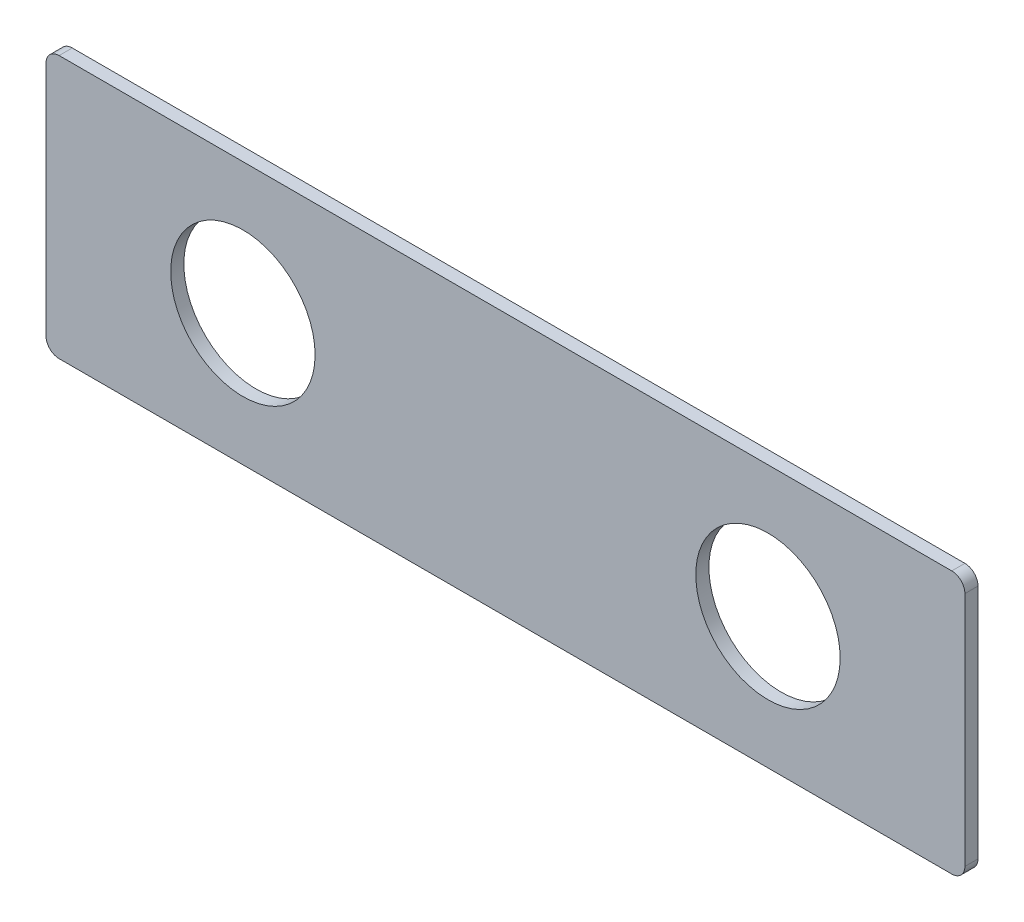
ISO-10303-21;
HEADER;
FILE_DESCRIPTION(('STEP AP214'),'2;1');
FILE_NAME('part.step','',(''),(''),'','','');
FILE_SCHEMA(('AUTOMOTIVE_DESIGN { 1 0 10303 214 1 1 1 1 }'));
ENDSEC;
DATA;
#1=APPLICATION_CONTEXT('core data for automotive mechanical design processes');
#2=APPLICATION_PROTOCOL_DEFINITION('international standard','automotive_design',2000,#1);
#3=PRODUCT_CONTEXT('',#1,'mechanical');
#4=PRODUCT('Part','Part','',(#3));
#5=PRODUCT_RELATED_PRODUCT_CATEGORY('part','',(#4));
#6=PRODUCT_DEFINITION_FORMATION('','',#4);
#7=PRODUCT_DEFINITION_CONTEXT('part definition',#1,'design');
#8=PRODUCT_DEFINITION('design','',#6,#7);
#9=PRODUCT_DEFINITION_SHAPE('','',#8);
#10=(LENGTH_UNIT() NAMED_UNIT(*) SI_UNIT(.MILLI.,.METRE.));
#11=(NAMED_UNIT(*) PLANE_ANGLE_UNIT() SI_UNIT($,.RADIAN.));
#12=(NAMED_UNIT(*) SI_UNIT($,.STERADIAN.) SOLID_ANGLE_UNIT());
#13=UNCERTAINTY_MEASURE_WITH_UNIT(LENGTH_MEASURE(1.E-05),#10,'distance_accuracy_value','');
#14=(GEOMETRIC_REPRESENTATION_CONTEXT(3) GLOBAL_UNCERTAINTY_ASSIGNED_CONTEXT((#13)) GLOBAL_UNIT_ASSIGNED_CONTEXT((#10,
#11,#12)) REPRESENTATION_CONTEXT('',''));
#15=CARTESIAN_POINT('',(0.,0.,0.));
#16=DIRECTION('',(0.,0.,1.));
#17=DIRECTION('',(1.,0.,0.));
#18=AXIS2_PLACEMENT_3D('',#15,#16,#17);
#19=CARTESIAN_POINT('',(-34.,0.999999999999992,0.5));
#20=DIRECTION('',(0.,0.,-1.));
#21=DIRECTION('',(-1.,0.,0.));
#22=AXIS2_PLACEMENT_3D('',#19,#20,#21);
#23=PLANE('',#22);
#24=CARTESIAN_POINT('',(-20.,9.99999999999999,0.5));
#25=DIRECTION('',(0.,0.,1.));
#26=DIRECTION('',(1.,0.,0.));
#27=AXIS2_PLACEMENT_3D('',#24,#25,#26);
#28=CIRCLE('',#27,5.5);
#29=CARTESIAN_POINT('',(-14.5,9.99999999999999,0.5));
#30=VERTEX_POINT('',#29);
#31=EDGE_CURVE('E140',#30,#30,#28,.T.);
#32=ORIENTED_EDGE('',*,*,#31,.F.);
#33=EDGE_LOOP('',(#32));
#34=FACE_BOUND('',#33,.T.);
#35=CARTESIAN_POINT('',(-34.,0.999999999999992,0.5));
#36=DIRECTION('',(0.,0.,1.));
#37=DIRECTION('',(-1.,0.,0.));
#38=AXIS2_PLACEMENT_3D('',#35,#36,#37);
#39=CIRCLE('',#38,1.);
#40=CARTESIAN_POINT('',(-35.,0.999999999999992,0.5));
#41=VERTEX_POINT('',#40);
#42=CARTESIAN_POINT('',(-34.,0.,0.5));
#43=VERTEX_POINT('',#42);
#44=EDGE_CURVE('E151',#41,#43,#39,.T.);
#45=ORIENTED_EDGE('',*,*,#44,.T.);
#46=DIRECTION('',(1.,0.,0.));
#47=VECTOR('',#46,1.);
#48=CARTESIAN_POINT('',(34.,0.,0.5));
#49=LINE('',#48,#47);
#50=CARTESIAN_POINT('',(34.,0.,0.5));
#51=VERTEX_POINT('',#50);
#52=EDGE_CURVE('E99',#43,#51,#49,.T.);
#53=ORIENTED_EDGE('',*,*,#52,.T.);
#54=CARTESIAN_POINT('',(34.,0.999999999999992,0.5));
#55=DIRECTION('',(0.,0.,1.));
#56=DIRECTION('',(1.,0.,0.));
#57=AXIS2_PLACEMENT_3D('',#54,#55,#56);
#58=CIRCLE('',#57,1.);
#59=CARTESIAN_POINT('',(35.,0.999999999999992,0.5));
#60=VERTEX_POINT('',#59);
#61=EDGE_CURVE('E166',#51,#60,#58,.T.);
#62=ORIENTED_EDGE('',*,*,#61,.T.);
#63=DIRECTION('',(0.,1.,0.));
#64=VECTOR('',#63,1.);
#65=CARTESIAN_POINT('',(35.,0.999999999999992,0.5));
#66=LINE('',#65,#64);
#67=CARTESIAN_POINT('',(35.,19.,0.5));
#68=VERTEX_POINT('',#67);
#69=EDGE_CURVE('E179',#60,#68,#66,.T.);
#70=ORIENTED_EDGE('',*,*,#69,.T.);
#71=CARTESIAN_POINT('',(34.,19.,0.5));
#72=DIRECTION('',(0.,0.,1.));
#73=DIRECTION('',(1.,0.,0.));
#74=AXIS2_PLACEMENT_3D('',#71,#72,#73);
#75=CIRCLE('',#74,1.);
#76=CARTESIAN_POINT('',(34.,20.,0.5));
#77=VERTEX_POINT('',#76);
#78=EDGE_CURVE('E118',#68,#77,#75,.T.);
#79=ORIENTED_EDGE('',*,*,#78,.T.);
#80=DIRECTION('',(-1.,0.,0.));
#81=VECTOR('',#80,1.);
#82=CARTESIAN_POINT('',(34.,20.,0.5));
#83=LINE('',#82,#81);
#84=CARTESIAN_POINT('',(-34.,20.,0.5));
#85=VERTEX_POINT('',#84);
#86=EDGE_CURVE('E112',#77,#85,#83,.T.);
#87=ORIENTED_EDGE('',*,*,#86,.T.);
#88=CARTESIAN_POINT('',(-34.,19.,0.5));
#89=DIRECTION('',(0.,0.,1.));
#90=DIRECTION('',(1.,0.,0.));
#91=AXIS2_PLACEMENT_3D('',#88,#89,#90);
#92=CIRCLE('',#91,1.);
#93=CARTESIAN_POINT('',(-35.,19.,0.5));
#94=VERTEX_POINT('',#93);
#95=EDGE_CURVE('E116',#85,#94,#92,.T.);
#96=ORIENTED_EDGE('',*,*,#95,.T.);
#97=DIRECTION('',(0.,-1.,0.));
#98=VECTOR('',#97,1.);
#99=CARTESIAN_POINT('',(-35.,0.999999999999992,0.5));
#100=LINE('',#99,#98);
#101=EDGE_CURVE('E56',#94,#41,#100,.T.);
#102=ORIENTED_EDGE('',*,*,#101,.T.);
#103=EDGE_LOOP('',(#45,#53,#62,#70,#79,#87,#96,#102));
#104=FACE_BOUND('',#103,.T.);
#105=CARTESIAN_POINT('',(20.,9.99999999999999,0.5));
#106=DIRECTION('',(0.,0.,1.));
#107=DIRECTION('',(1.,0.,0.));
#108=AXIS2_PLACEMENT_3D('',#105,#106,#107);
#109=CIRCLE('',#108,5.5);
#110=CARTESIAN_POINT('',(25.5,9.99999999999999,0.5));
#111=VERTEX_POINT('',#110);
#112=EDGE_CURVE('E188',#111,#111,#109,.T.);
#113=ORIENTED_EDGE('',*,*,#112,.F.);
#114=EDGE_LOOP('',(#113));
#115=FACE_BOUND('',#114,.T.);
#116=ADVANCED_FACE('F39',(#34,#104,#115),#23,.F.);
#117=CARTESIAN_POINT('',(-34.,0.999999999999992,-0.5));
#118=DIRECTION('',(0.,0.,-1.));
#119=DIRECTION('',(-1.,0.,0.));
#120=AXIS2_PLACEMENT_3D('',#117,#118,#119);
#121=PLANE('',#120);
#122=CARTESIAN_POINT('',(-20.,9.99999999999999,-0.5));
#123=DIRECTION('',(0.,0.,1.));
#124=DIRECTION('',(1.,0.,0.));
#125=AXIS2_PLACEMENT_3D('',#122,#123,#124);
#126=CIRCLE('',#125,5.5);
#127=CARTESIAN_POINT('',(-14.5,9.99999999999999,-0.5));
#128=VERTEX_POINT('',#127);
#129=EDGE_CURVE('E185',#128,#128,#126,.T.);
#130=ORIENTED_EDGE('',*,*,#129,.T.);
#131=EDGE_LOOP('',(#130));
#132=FACE_BOUND('',#131,.T.);
#133=CARTESIAN_POINT('',(-34.,0.999999999999992,-0.5));
#134=DIRECTION('',(0.,0.,1.));
#135=DIRECTION('',(-1.,0.,0.));
#136=AXIS2_PLACEMENT_3D('',#133,#134,#135);
#137=CIRCLE('',#136,1.);
#138=CARTESIAN_POINT('',(-35.,0.999999999999992,-0.5));
#139=VERTEX_POINT('',#138);
#140=CARTESIAN_POINT('',(-34.,0.,-0.5));
#141=VERTEX_POINT('',#140);
#142=EDGE_CURVE('E136',#139,#141,#137,.T.);
#143=ORIENTED_EDGE('',*,*,#142,.F.);
#144=DIRECTION('',(0.,-1.,0.));
#145=VECTOR('',#144,1.);
#146=CARTESIAN_POINT('',(-35.,0.999999999999992,-0.5));
#147=LINE('',#146,#145);
#148=CARTESIAN_POINT('',(-35.,19.,-0.5));
#149=VERTEX_POINT('',#148);
#150=EDGE_CURVE('E91',#149,#139,#147,.T.);
#151=ORIENTED_EDGE('',*,*,#150,.F.);
#152=CARTESIAN_POINT('',(-34.,19.,-0.5));
#153=DIRECTION('',(0.,0.,1.));
#154=DIRECTION('',(1.,0.,0.));
#155=AXIS2_PLACEMENT_3D('',#152,#153,#154);
#156=CIRCLE('',#155,1.);
#157=CARTESIAN_POINT('',(-34.,20.,-0.5));
#158=VERTEX_POINT('',#157);
#159=EDGE_CURVE('E85',#158,#149,#156,.T.);
#160=ORIENTED_EDGE('',*,*,#159,.F.);
#161=DIRECTION('',(-1.,0.,0.));
#162=VECTOR('',#161,1.);
#163=CARTESIAN_POINT('',(34.,20.,-0.5));
#164=LINE('',#163,#162);
#165=CARTESIAN_POINT('',(34.,20.,-0.5));
#166=VERTEX_POINT('',#165);
#167=EDGE_CURVE('E126',#166,#158,#164,.T.);
#168=ORIENTED_EDGE('',*,*,#167,.F.);
#169=CARTESIAN_POINT('',(34.,19.,-0.5));
#170=DIRECTION('',(0.,0.,1.));
#171=DIRECTION('',(1.,0.,0.));
#172=AXIS2_PLACEMENT_3D('',#169,#170,#171);
#173=CIRCLE('',#172,1.);
#174=CARTESIAN_POINT('',(35.,19.,-0.5));
#175=VERTEX_POINT('',#174);
#176=EDGE_CURVE('E146',#175,#166,#173,.T.);
#177=ORIENTED_EDGE('',*,*,#176,.F.);
#178=DIRECTION('',(0.,1.,0.));
#179=VECTOR('',#178,1.);
#180=CARTESIAN_POINT('',(35.,0.999999999999992,-0.5));
#181=LINE('',#180,#179);
#182=CARTESIAN_POINT('',(35.,0.999999999999992,-0.5));
#183=VERTEX_POINT('',#182);
#184=EDGE_CURVE('E144',#183,#175,#181,.T.);
#185=ORIENTED_EDGE('',*,*,#184,.F.);
#186=CARTESIAN_POINT('',(34.,0.999999999999992,-0.5));
#187=DIRECTION('',(0.,0.,1.));
#188=DIRECTION('',(1.,0.,0.));
#189=AXIS2_PLACEMENT_3D('',#186,#187,#188);
#190=CIRCLE('',#189,1.);
#191=CARTESIAN_POINT('',(34.,0.,-0.5));
#192=VERTEX_POINT('',#191);
#193=EDGE_CURVE('E142',#192,#183,#190,.T.);
#194=ORIENTED_EDGE('',*,*,#193,.F.);
#195=DIRECTION('',(1.,0.,0.));
#196=VECTOR('',#195,1.);
#197=CARTESIAN_POINT('',(34.,0.,-0.5));
#198=LINE('',#197,#196);
#199=EDGE_CURVE('E139',#141,#192,#198,.T.);
#200=ORIENTED_EDGE('',*,*,#199,.F.);
#201=EDGE_LOOP('',(#143,#151,#160,#168,#177,#185,#194,#200));
#202=FACE_BOUND('',#201,.T.);
#203=CARTESIAN_POINT('',(20.,9.99999999999999,-0.5));
#204=DIRECTION('',(0.,0.,1.));
#205=DIRECTION('',(1.,0.,0.));
#206=AXIS2_PLACEMENT_3D('',#203,#204,#205);
#207=CIRCLE('',#206,5.5);
#208=CARTESIAN_POINT('',(25.5,9.99999999999999,-0.5));
#209=VERTEX_POINT('',#208);
#210=EDGE_CURVE('E191',#209,#209,#207,.T.);
#211=ORIENTED_EDGE('',*,*,#210,.T.);
#212=EDGE_LOOP('',(#211));
#213=FACE_BOUND('',#212,.T.);
#214=ADVANCED_FACE('F170',(#132,#202,#213),#121,.T.);
#215=CARTESIAN_POINT('',(-34.,0.999999999999992,0.5));
#216=DIRECTION('',(0.,0.,-1.));
#217=DIRECTION('',(-1.,0.,0.));
#218=AXIS2_PLACEMENT_3D('',#215,#216,#217);
#219=CYLINDRICAL_SURFACE('',#218,1.);
#220=ORIENTED_EDGE('',*,*,#142,.T.);
#221=DIRECTION('',(0.,0.,-1.));
#222=VECTOR('',#221,1.);
#223=CARTESIAN_POINT('',(-34.,0.,0.5));
#224=LINE('',#223,#222);
#225=EDGE_CURVE('E11',#43,#141,#224,.T.);
#226=ORIENTED_EDGE('',*,*,#225,.F.);
#227=ORIENTED_EDGE('',*,*,#44,.F.);
#228=DIRECTION('',(0.,0.,-1.));
#229=VECTOR('',#228,1.);
#230=CARTESIAN_POINT('',(-35.,0.999999999999992,0.5));
#231=LINE('',#230,#229);
#232=EDGE_CURVE('E132',#41,#139,#231,.T.);
#233=ORIENTED_EDGE('',*,*,#232,.T.);
#234=EDGE_LOOP('',(#220,#226,#227,#233));
#235=FACE_BOUND('',#234,.T.);
#236=ADVANCED_FACE('F41',(#235),#219,.T.);
#237=CARTESIAN_POINT('',(34.,0.,0.5));
#238=DIRECTION('',(0.,1.,0.));
#239=DIRECTION('',(0.,0.,1.));
#240=AXIS2_PLACEMENT_3D('',#237,#238,#239);
#241=PLANE('',#240);
#242=ORIENTED_EDGE('',*,*,#199,.T.);
#243=DIRECTION('',(0.,0.,-1.));
#244=VECTOR('',#243,1.);
#245=CARTESIAN_POINT('',(34.,0.,0.5));
#246=LINE('',#245,#244);
#247=EDGE_CURVE('E48',#51,#192,#246,.T.);
#248=ORIENTED_EDGE('',*,*,#247,.F.);
#249=ORIENTED_EDGE('',*,*,#52,.F.);
#250=ORIENTED_EDGE('',*,*,#225,.T.);
#251=EDGE_LOOP('',(#242,#248,#249,#250));
#252=FACE_BOUND('',#251,.T.);
#253=ADVANCED_FACE('F224',(#252),#241,.F.);
#254=CARTESIAN_POINT('',(34.,0.999999999999992,0.5));
#255=DIRECTION('',(0.,0.,-1.));
#256=DIRECTION('',(-1.,0.,0.));
#257=AXIS2_PLACEMENT_3D('',#254,#255,#256);
#258=CYLINDRICAL_SURFACE('',#257,1.);
#259=ORIENTED_EDGE('',*,*,#193,.T.);
#260=DIRECTION('',(0.,0.,-1.));
#261=VECTOR('',#260,1.);
#262=CARTESIAN_POINT('',(35.,0.999999999999992,0.5));
#263=LINE('',#262,#261);
#264=EDGE_CURVE('E158',#60,#183,#263,.T.);
#265=ORIENTED_EDGE('',*,*,#264,.F.);
#266=ORIENTED_EDGE('',*,*,#61,.F.);
#267=ORIENTED_EDGE('',*,*,#247,.T.);
#268=EDGE_LOOP('',(#259,#265,#266,#267));
#269=FACE_BOUND('',#268,.T.);
#270=ADVANCED_FACE('F164',(#269),#258,.T.);
#271=CARTESIAN_POINT('',(35.,0.999999999999992,0.5));
#272=DIRECTION('',(-1.,0.,0.));
#273=DIRECTION('',(0.,0.,1.));
#274=AXIS2_PLACEMENT_3D('',#271,#272,#273);
#275=PLANE('',#274);
#276=ORIENTED_EDGE('',*,*,#184,.T.);
#277=DIRECTION('',(0.,0.,-1.));
#278=VECTOR('',#277,1.);
#279=CARTESIAN_POINT('',(35.,19.,0.5));
#280=LINE('',#279,#278);
#281=EDGE_CURVE('E155',#68,#175,#280,.T.);
#282=ORIENTED_EDGE('',*,*,#281,.F.);
#283=ORIENTED_EDGE('',*,*,#69,.F.);
#284=ORIENTED_EDGE('',*,*,#264,.T.);
#285=EDGE_LOOP('',(#276,#282,#283,#284));
#286=FACE_BOUND('',#285,.T.);
#287=ADVANCED_FACE('F175',(#286),#275,.F.);
#288=CARTESIAN_POINT('',(34.,19.,0.5));
#289=DIRECTION('',(0.,0.,-1.));
#290=DIRECTION('',(-1.,0.,0.));
#291=AXIS2_PLACEMENT_3D('',#288,#289,#290);
#292=CYLINDRICAL_SURFACE('',#291,1.);
#293=ORIENTED_EDGE('',*,*,#176,.T.);
#294=DIRECTION('',(0.,0.,-1.));
#295=VECTOR('',#294,1.);
#296=CARTESIAN_POINT('',(34.,20.,0.5));
#297=LINE('',#296,#295);
#298=EDGE_CURVE('E127',#77,#166,#297,.T.);
#299=ORIENTED_EDGE('',*,*,#298,.F.);
#300=ORIENTED_EDGE('',*,*,#78,.F.);
#301=ORIENTED_EDGE('',*,*,#281,.T.);
#302=EDGE_LOOP('',(#293,#299,#300,#301));
#303=FACE_BOUND('',#302,.T.);
#304=ADVANCED_FACE('F178',(#303),#292,.T.);
#305=CARTESIAN_POINT('',(34.,20.,0.5));
#306=DIRECTION('',(0.,-1.,0.));
#307=DIRECTION('',(0.,0.,-1.));
#308=AXIS2_PLACEMENT_3D('',#305,#306,#307);
#309=PLANE('',#308);
#310=ORIENTED_EDGE('',*,*,#167,.T.);
#311=DIRECTION('',(0.,0.,-1.));
#312=VECTOR('',#311,1.);
#313=CARTESIAN_POINT('',(-34.,20.,0.5));
#314=LINE('',#313,#312);
#315=EDGE_CURVE('E123',#85,#158,#314,.T.);
#316=ORIENTED_EDGE('',*,*,#315,.F.);
#317=ORIENTED_EDGE('',*,*,#86,.F.);
#318=ORIENTED_EDGE('',*,*,#298,.T.);
#319=EDGE_LOOP('',(#310,#316,#317,#318));
#320=FACE_BOUND('',#319,.T.);
#321=ADVANCED_FACE('F124',(#320),#309,.F.);
#322=CARTESIAN_POINT('',(-34.,19.,0.5));
#323=DIRECTION('',(0.,0.,-1.));
#324=DIRECTION('',(-1.,0.,0.));
#325=AXIS2_PLACEMENT_3D('',#322,#323,#324);
#326=CYLINDRICAL_SURFACE('',#325,1.);
#327=ORIENTED_EDGE('',*,*,#159,.T.);
#328=DIRECTION('',(0.,0.,-1.));
#329=VECTOR('',#328,1.);
#330=CARTESIAN_POINT('',(-35.,19.,0.5));
#331=LINE('',#330,#329);
#332=EDGE_CURVE('E128',#94,#149,#331,.T.);
#333=ORIENTED_EDGE('',*,*,#332,.F.);
#334=ORIENTED_EDGE('',*,*,#95,.F.);
#335=ORIENTED_EDGE('',*,*,#315,.T.);
#336=EDGE_LOOP('',(#327,#333,#334,#335));
#337=FACE_BOUND('',#336,.T.);
#338=ADVANCED_FACE('F130',(#337),#326,.T.);
#339=CARTESIAN_POINT('',(-35.,0.999999999999992,0.5));
#340=DIRECTION('',(1.,0.,0.));
#341=DIRECTION('',(0.,0.,-1.));
#342=AXIS2_PLACEMENT_3D('',#339,#340,#341);
#343=PLANE('',#342);
#344=ORIENTED_EDGE('',*,*,#150,.T.);
#345=ORIENTED_EDGE('',*,*,#232,.F.);
#346=ORIENTED_EDGE('',*,*,#101,.F.);
#347=ORIENTED_EDGE('',*,*,#332,.T.);
#348=EDGE_LOOP('',(#344,#345,#346,#347));
#349=FACE_BOUND('',#348,.T.);
#350=ADVANCED_FACE('F212',(#349),#343,.F.);
#351=CARTESIAN_POINT('',(-20.,9.99999999999999,0.5));
#352=DIRECTION('',(0.,0.,-1.));
#353=DIRECTION('',(-1.,0.,0.));
#354=AXIS2_PLACEMENT_3D('',#351,#352,#353);
#355=CYLINDRICAL_SURFACE('',#354,5.5);
#356=ORIENTED_EDGE('',*,*,#31,.T.);
#357=EDGE_LOOP('',(#356));
#358=FACE_BOUND('',#357,.T.);
#359=ORIENTED_EDGE('',*,*,#129,.F.);
#360=EDGE_LOOP('',(#359));
#361=FACE_BOUND('',#360,.T.);
#362=ADVANCED_FACE('F209',(#358,#361),#355,.F.);
#363=CARTESIAN_POINT('',(20.,9.99999999999999,0.5));
#364=DIRECTION('',(0.,0.,-1.));
#365=DIRECTION('',(-1.,0.,0.));
#366=AXIS2_PLACEMENT_3D('',#363,#364,#365);
#367=CYLINDRICAL_SURFACE('',#366,5.5);
#368=ORIENTED_EDGE('',*,*,#112,.T.);
#369=EDGE_LOOP('',(#368));
#370=FACE_BOUND('',#369,.T.);
#371=ORIENTED_EDGE('',*,*,#210,.F.);
#372=EDGE_LOOP('',(#371));
#373=FACE_BOUND('',#372,.T.);
#374=ADVANCED_FACE('F197',(#370,#373),#367,.F.);
#375=CLOSED_SHELL('',(#116,#214,#236,#253,#270,#287,#304,#321,#338,#350,#362,#374));
#376=MANIFOLD_SOLID_BREP('B2',#375);
#377=ADVANCED_BREP_SHAPE_REPRESENTATION('',(#18,#376),#14);
#378=SHAPE_DEFINITION_REPRESENTATION(#9,#377);
ENDSEC;
END-ISO-10303-21;
